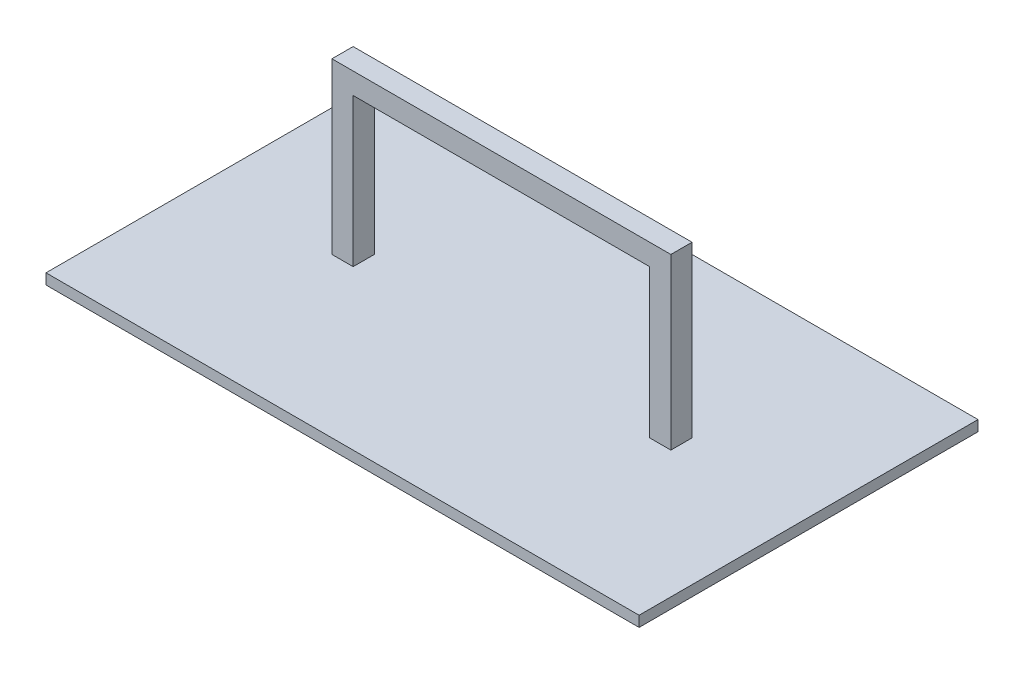
ISO-10303-21;
HEADER;
FILE_DESCRIPTION(('STEP AP214'),'2;1');
FILE_NAME('part.step','',(''),(''),'','','');
FILE_SCHEMA(('AUTOMOTIVE_DESIGN { 1 0 10303 214 1 1 1 1 }'));
ENDSEC;
DATA;
#1=APPLICATION_CONTEXT('core data for automotive mechanical design processes');
#2=APPLICATION_PROTOCOL_DEFINITION('international standard','automotive_design',2000,#1);
#3=PRODUCT_CONTEXT('',#1,'mechanical');
#4=PRODUCT('Part','Part','',(#3));
#5=PRODUCT_RELATED_PRODUCT_CATEGORY('part','',(#4));
#6=PRODUCT_DEFINITION_FORMATION('','',#4);
#7=PRODUCT_DEFINITION_CONTEXT('part definition',#1,'design');
#8=PRODUCT_DEFINITION('design','',#6,#7);
#9=PRODUCT_DEFINITION_SHAPE('','',#8);
#10=(LENGTH_UNIT() NAMED_UNIT(*) SI_UNIT(.MILLI.,.METRE.));
#11=(NAMED_UNIT(*) PLANE_ANGLE_UNIT() SI_UNIT($,.RADIAN.));
#12=(NAMED_UNIT(*) SI_UNIT($,.STERADIAN.) SOLID_ANGLE_UNIT());
#13=UNCERTAINTY_MEASURE_WITH_UNIT(LENGTH_MEASURE(1.E-05),#10,'distance_accuracy_value','');
#14=(GEOMETRIC_REPRESENTATION_CONTEXT(3) GLOBAL_UNCERTAINTY_ASSIGNED_CONTEXT((#13)) GLOBAL_UNIT_ASSIGNED_CONTEXT((#10,
#11,#12)) REPRESENTATION_CONTEXT('',''));
#15=CARTESIAN_POINT('',(0.,0.,0.));
#16=DIRECTION('',(0.,0.,1.));
#17=DIRECTION('',(1.,0.,0.));
#18=AXIS2_PLACEMENT_3D('',#15,#16,#17);
#19=CARTESIAN_POINT('',(0.,3.175,0.));
#20=DIRECTION('',(0.,1.,0.));
#21=DIRECTION('',(0.,0.,1.));
#22=AXIS2_PLACEMENT_3D('',#19,#20,#21);
#23=PLANE('',#22);
#24=DIRECTION('',(0.,0.,1.));
#25=VECTOR('',#24,1.);
#26=CARTESIAN_POINT('',(-177.8,3.175,-101.6));
#27=LINE('',#26,#25);
#28=CARTESIAN_POINT('',(-177.8,3.175,-101.6));
#29=VERTEX_POINT('',#28);
#30=CARTESIAN_POINT('',(-177.8,3.175,101.6));
#31=VERTEX_POINT('',#30);
#32=EDGE_CURVE('E187',#29,#31,#27,.T.);
#33=ORIENTED_EDGE('',*,*,#32,.T.);
#34=DIRECTION('',(1.,0.,0.));
#35=VECTOR('',#34,1.);
#36=CARTESIAN_POINT('',(-177.8,3.175,101.6));
#37=LINE('',#36,#35);
#38=CARTESIAN_POINT('',(177.8,3.175,101.6));
#39=VERTEX_POINT('',#38);
#40=EDGE_CURVE('E190',#31,#39,#37,.T.);
#41=ORIENTED_EDGE('',*,*,#40,.T.);
#42=DIRECTION('',(0.,0.,-1.));
#43=VECTOR('',#42,1.);
#44=CARTESIAN_POINT('',(177.8,3.175,-101.6));
#45=LINE('',#44,#43);
#46=CARTESIAN_POINT('',(177.8,3.175,-101.6));
#47=VERTEX_POINT('',#46);
#48=EDGE_CURVE('E193',#39,#47,#45,.T.);
#49=ORIENTED_EDGE('',*,*,#48,.T.);
#50=DIRECTION('',(-1.,0.,0.));
#51=VECTOR('',#50,1.);
#52=CARTESIAN_POINT('',(-177.8,3.175,-101.6));
#53=LINE('',#52,#51);
#54=EDGE_CURVE('E195',#47,#29,#53,.T.);
#55=ORIENTED_EDGE('',*,*,#54,.T.);
#56=EDGE_LOOP('',(#33,#41,#49,#55));
#57=FACE_BOUND('',#56,.T.);
#58=DIRECTION('',(0.,0.,-1.));
#59=VECTOR('',#58,1.);
#60=CARTESIAN_POINT('',(-88.9,3.17499999999998,6.35));
#61=LINE('',#60,#59);
#62=CARTESIAN_POINT('',(-88.9,3.175,6.35));
#63=VERTEX_POINT('',#62);
#64=CARTESIAN_POINT('',(-88.9,3.175,-6.35));
#65=VERTEX_POINT('',#64);
#66=EDGE_CURVE('E138',#63,#65,#61,.T.);
#67=ORIENTED_EDGE('',*,*,#66,.F.);
#68=DIRECTION('',(1.,0.,0.));
#69=VECTOR('',#68,1.);
#70=CARTESIAN_POINT('',(-88.9,3.17499999999998,6.35));
#71=LINE('',#70,#69);
#72=CARTESIAN_POINT('',(-101.6,3.175,6.35));
#73=VERTEX_POINT('',#72);
#74=EDGE_CURVE('E127',#73,#63,#71,.T.);
#75=ORIENTED_EDGE('',*,*,#74,.F.);
#76=DIRECTION('',(0.,0.,-1.));
#77=VECTOR('',#76,1.);
#78=CARTESIAN_POINT('',(-101.6,3.17499999999998,6.35));
#79=LINE('',#78,#77);
#80=CARTESIAN_POINT('',(-101.6,3.17499999999998,-6.35));
#81=VERTEX_POINT('',#80);
#82=EDGE_CURVE('E156',#73,#81,#79,.T.);
#83=ORIENTED_EDGE('',*,*,#82,.T.);
#84=DIRECTION('',(1.,0.,0.));
#85=VECTOR('',#84,1.);
#86=CARTESIAN_POINT('',(-88.9,3.17499999999998,-6.35));
#87=LINE('',#86,#85);
#88=EDGE_CURVE('E157',#81,#65,#87,.T.);
#89=ORIENTED_EDGE('',*,*,#88,.T.);
#90=EDGE_LOOP('',(#67,#75,#83,#89));
#91=FACE_BOUND('',#90,.T.);
#92=DIRECTION('',(0.,0.,-1.));
#93=VECTOR('',#92,1.);
#94=CARTESIAN_POINT('',(101.6,3.17500000000001,6.35));
#95=LINE('',#94,#93);
#96=CARTESIAN_POINT('',(101.6,3.175,6.35));
#97=VERTEX_POINT('',#96);
#98=CARTESIAN_POINT('',(101.6,3.175,-6.35));
#99=VERTEX_POINT('',#98);
#100=EDGE_CURVE('E53',#97,#99,#95,.T.);
#101=ORIENTED_EDGE('',*,*,#100,.F.);
#102=DIRECTION('',(1.,0.,0.));
#103=VECTOR('',#102,1.);
#104=CARTESIAN_POINT('',(101.6,3.17500000000001,6.35));
#105=LINE('',#104,#103);
#106=CARTESIAN_POINT('',(88.9,3.175,6.35));
#107=VERTEX_POINT('',#106);
#108=EDGE_CURVE('E48',#107,#97,#105,.T.);
#109=ORIENTED_EDGE('',*,*,#108,.F.);
#110=DIRECTION('',(0.,0.,-1.));
#111=VECTOR('',#110,1.);
#112=CARTESIAN_POINT('',(88.9,3.175,6.35));
#113=LINE('',#112,#111);
#114=CARTESIAN_POINT('',(88.9,3.175,-6.35));
#115=VERTEX_POINT('',#114);
#116=EDGE_CURVE('E182',#107,#115,#113,.T.);
#117=ORIENTED_EDGE('',*,*,#116,.T.);
#118=DIRECTION('',(1.,0.,0.));
#119=VECTOR('',#118,1.);
#120=CARTESIAN_POINT('',(101.6,3.17500000000001,-6.35));
#121=LINE('',#120,#119);
#122=EDGE_CURVE('E165',#115,#99,#121,.T.);
#123=ORIENTED_EDGE('',*,*,#122,.T.);
#124=EDGE_LOOP('',(#101,#109,#117,#123));
#125=FACE_BOUND('',#124,.T.);
#126=ADVANCED_FACE('F33',(#57,#91,#125),#23,.T.);
#127=CARTESIAN_POINT('',(-177.8,3.175,-101.6));
#128=DIRECTION('',(1.,0.,0.));
#129=DIRECTION('',(0.,0.,-1.));
#130=AXIS2_PLACEMENT_3D('',#127,#128,#129);
#131=PLANE('',#130);
#132=DIRECTION('',(0.,0.,1.));
#133=VECTOR('',#132,1.);
#134=CARTESIAN_POINT('',(-177.8,-3.175,-101.6));
#135=LINE('',#134,#133);
#136=CARTESIAN_POINT('',(-177.8,-3.175,-101.6));
#137=VERTEX_POINT('',#136);
#138=CARTESIAN_POINT('',(-177.8,-3.175,101.6));
#139=VERTEX_POINT('',#138);
#140=EDGE_CURVE('E186',#137,#139,#135,.T.);
#141=ORIENTED_EDGE('',*,*,#140,.T.);
#142=DIRECTION('',(0.,-1.,0.));
#143=VECTOR('',#142,1.);
#144=CARTESIAN_POINT('',(-177.8,3.175,101.6));
#145=LINE('',#144,#143);
#146=EDGE_CURVE('E11',#31,#139,#145,.T.);
#147=ORIENTED_EDGE('',*,*,#146,.F.);
#148=ORIENTED_EDGE('',*,*,#32,.F.);
#149=DIRECTION('',(0.,-1.,0.));
#150=VECTOR('',#149,1.);
#151=CARTESIAN_POINT('',(-177.8,3.175,-101.6));
#152=LINE('',#151,#150);
#153=EDGE_CURVE('E197',#29,#137,#152,.T.);
#154=ORIENTED_EDGE('',*,*,#153,.T.);
#155=EDGE_LOOP('',(#141,#147,#148,#154));
#156=FACE_BOUND('',#155,.T.);
#157=ADVANCED_FACE('F35',(#156),#131,.F.);
#158=CARTESIAN_POINT('',(-177.8,3.175,101.6));
#159=DIRECTION('',(0.,0.,-1.));
#160=DIRECTION('',(-1.,0.,0.));
#161=AXIS2_PLACEMENT_3D('',#158,#159,#160);
#162=PLANE('',#161);
#163=DIRECTION('',(1.,0.,0.));
#164=VECTOR('',#163,1.);
#165=CARTESIAN_POINT('',(-177.8,-3.175,101.6));
#166=LINE('',#165,#164);
#167=CARTESIAN_POINT('',(177.8,-3.175,101.6));
#168=VERTEX_POINT('',#167);
#169=EDGE_CURVE('E200',#139,#168,#166,.T.);
#170=ORIENTED_EDGE('',*,*,#169,.T.);
#171=DIRECTION('',(0.,-1.,0.));
#172=VECTOR('',#171,1.);
#173=CARTESIAN_POINT('',(177.8,3.175,101.6));
#174=LINE('',#173,#172);
#175=EDGE_CURVE('E41',#39,#168,#174,.T.);
#176=ORIENTED_EDGE('',*,*,#175,.F.);
#177=ORIENTED_EDGE('',*,*,#40,.F.);
#178=ORIENTED_EDGE('',*,*,#146,.T.);
#179=EDGE_LOOP('',(#170,#176,#177,#178));
#180=FACE_BOUND('',#179,.T.);
#181=ADVANCED_FACE('F230',(#180),#162,.F.);
#182=CARTESIAN_POINT('',(177.8,3.175,-101.6));
#183=DIRECTION('',(-1.,0.,0.));
#184=DIRECTION('',(0.,0.,1.));
#185=AXIS2_PLACEMENT_3D('',#182,#183,#184);
#186=PLANE('',#185);
#187=DIRECTION('',(0.,0.,-1.));
#188=VECTOR('',#187,1.);
#189=CARTESIAN_POINT('',(177.8,-3.175,-101.6));
#190=LINE('',#189,#188);
#191=CARTESIAN_POINT('',(177.8,-3.175,-101.6));
#192=VERTEX_POINT('',#191);
#193=EDGE_CURVE('E202',#168,#192,#190,.T.);
#194=ORIENTED_EDGE('',*,*,#193,.T.);
#195=DIRECTION('',(0.,-1.,0.));
#196=VECTOR('',#195,1.);
#197=CARTESIAN_POINT('',(177.8,3.175,-101.6));
#198=LINE('',#197,#196);
#199=EDGE_CURVE('E207',#47,#192,#198,.T.);
#200=ORIENTED_EDGE('',*,*,#199,.F.);
#201=ORIENTED_EDGE('',*,*,#48,.F.);
#202=ORIENTED_EDGE('',*,*,#175,.T.);
#203=EDGE_LOOP('',(#194,#200,#201,#202));
#204=FACE_BOUND('',#203,.T.);
#205=ADVANCED_FACE('F214',(#204),#186,.F.);
#206=CARTESIAN_POINT('',(-177.8,3.175,-101.6));
#207=DIRECTION('',(0.,0.,1.));
#208=DIRECTION('',(1.,0.,0.));
#209=AXIS2_PLACEMENT_3D('',#206,#207,#208);
#210=PLANE('',#209);
#211=DIRECTION('',(-1.,0.,0.));
#212=VECTOR('',#211,1.);
#213=CARTESIAN_POINT('',(-177.8,-3.175,-101.6));
#214=LINE('',#213,#212);
#215=EDGE_CURVE('E191',#192,#137,#214,.T.);
#216=ORIENTED_EDGE('',*,*,#215,.T.);
#217=ORIENTED_EDGE('',*,*,#153,.F.);
#218=ORIENTED_EDGE('',*,*,#54,.F.);
#219=ORIENTED_EDGE('',*,*,#199,.T.);
#220=EDGE_LOOP('',(#216,#217,#218,#219));
#221=FACE_BOUND('',#220,.T.);
#222=ADVANCED_FACE('F223',(#221),#210,.F.);
#223=CARTESIAN_POINT('',(0.,-3.175,0.));
#224=DIRECTION('',(0.,1.,0.));
#225=DIRECTION('',(0.,0.,1.));
#226=AXIS2_PLACEMENT_3D('',#223,#224,#225);
#227=PLANE('',#226);
#228=ORIENTED_EDGE('',*,*,#140,.F.);
#229=ORIENTED_EDGE('',*,*,#215,.F.);
#230=ORIENTED_EDGE('',*,*,#193,.F.);
#231=ORIENTED_EDGE('',*,*,#169,.F.);
#232=EDGE_LOOP('',(#228,#229,#230,#231));
#233=FACE_BOUND('',#232,.T.);
#234=ADVANCED_FACE('F220',(#233),#227,.F.);
#235=CARTESIAN_POINT('',(-88.9,92.0749999999999,6.35));
#236=DIRECTION('',(-1.,0.,0.));
#237=DIRECTION('',(0.,-1.,0.));
#238=AXIS2_PLACEMENT_3D('',#235,#236,#237);
#239=PLANE('',#238);
#240=DIRECTION('',(0.,1.,0.));
#241=VECTOR('',#240,1.);
#242=CARTESIAN_POINT('',(-88.9,92.0749999999999,-6.35));
#243=LINE('',#242,#241);
#244=CARTESIAN_POINT('',(-88.9,92.0749999999999,-6.35));
#245=VERTEX_POINT('',#244);
#246=EDGE_CURVE('E135',#65,#245,#243,.T.);
#247=ORIENTED_EDGE('',*,*,#246,.T.);
#248=DIRECTION('',(0.,0.,-1.));
#249=VECTOR('',#248,1.);
#250=CARTESIAN_POINT('',(-88.9,92.0749999999999,6.35));
#251=LINE('',#250,#249);
#252=CARTESIAN_POINT('',(-88.9,92.0749999999999,6.35));
#253=VERTEX_POINT('',#252);
#254=EDGE_CURVE('E132',#253,#245,#251,.T.);
#255=ORIENTED_EDGE('',*,*,#254,.F.);
#256=DIRECTION('',(0.,1.,0.));
#257=VECTOR('',#256,1.);
#258=CARTESIAN_POINT('',(-88.9,92.0749999999999,6.35));
#259=LINE('',#258,#257);
#260=EDGE_CURVE('E120',#63,#253,#259,.T.);
#261=ORIENTED_EDGE('',*,*,#260,.F.);
#262=ORIENTED_EDGE('',*,*,#66,.T.);
#263=EDGE_LOOP('',(#247,#255,#261,#262));
#264=FACE_BOUND('',#263,.T.);
#265=ADVANCED_FACE('F133',(#264),#239,.F.);
#266=CARTESIAN_POINT('',(88.9,92.075,6.35));
#267=DIRECTION('',(0.,1.,0.));
#268=DIRECTION('',(-1.,0.,0.));
#269=AXIS2_PLACEMENT_3D('',#266,#267,#268);
#270=PLANE('',#269);
#271=DIRECTION('',(1.,0.,0.));
#272=VECTOR('',#271,1.);
#273=CARTESIAN_POINT('',(88.9,92.075,-6.35));
#274=LINE('',#273,#272);
#275=CARTESIAN_POINT('',(88.9,92.075,-6.35));
#276=VERTEX_POINT('',#275);
#277=EDGE_CURVE('E160',#245,#276,#274,.T.);
#278=ORIENTED_EDGE('',*,*,#277,.T.);
#279=DIRECTION('',(0.,0.,-1.));
#280=VECTOR('',#279,1.);
#281=CARTESIAN_POINT('',(88.9,92.075,6.35));
#282=LINE('',#281,#280);
#283=CARTESIAN_POINT('',(88.9,92.075,6.35));
#284=VERTEX_POINT('',#283);
#285=EDGE_CURVE('E139',#284,#276,#282,.T.);
#286=ORIENTED_EDGE('',*,*,#285,.F.);
#287=DIRECTION('',(1.,0.,0.));
#288=VECTOR('',#287,1.);
#289=CARTESIAN_POINT('',(88.9,92.075,6.35));
#290=LINE('',#289,#288);
#291=EDGE_CURVE('E124',#253,#284,#290,.T.);
#292=ORIENTED_EDGE('',*,*,#291,.F.);
#293=ORIENTED_EDGE('',*,*,#254,.T.);
#294=EDGE_LOOP('',(#278,#286,#292,#293));
#295=FACE_BOUND('',#294,.T.);
#296=ADVANCED_FACE('F141',(#295),#270,.F.);
#297=CARTESIAN_POINT('',(88.9,3.175,6.35));
#298=DIRECTION('',(1.,0.,0.));
#299=DIRECTION('',(0.,1.,0.));
#300=AXIS2_PLACEMENT_3D('',#297,#298,#299);
#301=PLANE('',#300);
#302=DIRECTION('',(0.,-1.,0.));
#303=VECTOR('',#302,1.);
#304=CARTESIAN_POINT('',(88.9,3.175,-6.35));
#305=LINE('',#304,#303);
#306=EDGE_CURVE('E162',#276,#115,#305,.T.);
#307=ORIENTED_EDGE('',*,*,#306,.T.);
#308=ORIENTED_EDGE('',*,*,#116,.F.);
#309=DIRECTION('',(0.,-1.,0.));
#310=VECTOR('',#309,1.);
#311=CARTESIAN_POINT('',(88.9,3.175,6.35));
#312=LINE('',#311,#310);
#313=EDGE_CURVE('E144',#284,#107,#312,.T.);
#314=ORIENTED_EDGE('',*,*,#313,.F.);
#315=ORIENTED_EDGE('',*,*,#285,.T.);
#316=EDGE_LOOP('',(#307,#308,#314,#315));
#317=FACE_BOUND('',#316,.T.);
#318=ADVANCED_FACE('F266',(#317),#301,.F.);
#319=CARTESIAN_POINT('',(101.6,104.775,6.35));
#320=DIRECTION('',(-1.,0.,0.));
#321=DIRECTION('',(0.,-1.,0.));
#322=AXIS2_PLACEMENT_3D('',#319,#320,#321);
#323=PLANE('',#322);
#324=DIRECTION('',(0.,1.,0.));
#325=VECTOR('',#324,1.);
#326=CARTESIAN_POINT('',(101.6,104.775,-6.35));
#327=LINE('',#326,#325);
#328=CARTESIAN_POINT('',(101.6,104.775,-6.35));
#329=VERTEX_POINT('',#328);
#330=EDGE_CURVE('E167',#99,#329,#327,.T.);
#331=ORIENTED_EDGE('',*,*,#330,.T.);
#332=DIRECTION('',(0.,0.,-1.));
#333=VECTOR('',#332,1.);
#334=CARTESIAN_POINT('',(101.6,104.775,6.35));
#335=LINE('',#334,#333);
#336=CARTESIAN_POINT('',(101.6,104.775,6.35));
#337=VERTEX_POINT('',#336);
#338=EDGE_CURVE('E178',#337,#329,#335,.T.);
#339=ORIENTED_EDGE('',*,*,#338,.F.);
#340=DIRECTION('',(0.,1.,0.));
#341=VECTOR('',#340,1.);
#342=CARTESIAN_POINT('',(101.6,104.775,6.35));
#343=LINE('',#342,#341);
#344=EDGE_CURVE('E150',#97,#337,#343,.T.);
#345=ORIENTED_EDGE('',*,*,#344,.F.);
#346=ORIENTED_EDGE('',*,*,#100,.T.);
#347=EDGE_LOOP('',(#331,#339,#345,#346));
#348=FACE_BOUND('',#347,.T.);
#349=ADVANCED_FACE('F272',(#348),#323,.F.);
#350=CARTESIAN_POINT('',(-101.6,104.775,6.35));
#351=DIRECTION('',(0.,-1.,0.));
#352=DIRECTION('',(1.,0.,0.));
#353=AXIS2_PLACEMENT_3D('',#350,#351,#352);
#354=PLANE('',#353);
#355=DIRECTION('',(-1.,0.,0.));
#356=VECTOR('',#355,1.);
#357=CARTESIAN_POINT('',(-101.6,104.775,-6.35));
#358=LINE('',#357,#356);
#359=CARTESIAN_POINT('',(-101.6,104.775,-6.35));
#360=VERTEX_POINT('',#359);
#361=EDGE_CURVE('E169',#329,#360,#358,.T.);
#362=ORIENTED_EDGE('',*,*,#361,.T.);
#363=DIRECTION('',(0.,0.,-1.));
#364=VECTOR('',#363,1.);
#365=CARTESIAN_POINT('',(-101.6,104.775,6.35));
#366=LINE('',#365,#364);
#367=CARTESIAN_POINT('',(-101.6,104.775,6.35));
#368=VERTEX_POINT('',#367);
#369=EDGE_CURVE('E175',#368,#360,#366,.T.);
#370=ORIENTED_EDGE('',*,*,#369,.F.);
#371=DIRECTION('',(-1.,0.,0.));
#372=VECTOR('',#371,1.);
#373=CARTESIAN_POINT('',(-101.6,104.775,6.35));
#374=LINE('',#373,#372);
#375=EDGE_CURVE('E152',#337,#368,#374,.T.);
#376=ORIENTED_EDGE('',*,*,#375,.F.);
#377=ORIENTED_EDGE('',*,*,#338,.T.);
#378=EDGE_LOOP('',(#362,#370,#376,#377));
#379=FACE_BOUND('',#378,.T.);
#380=ADVANCED_FACE('F280',(#379),#354,.F.);
#381=CARTESIAN_POINT('',(-101.6,3.17499999999998,6.35));
#382=DIRECTION('',(1.,0.,0.));
#383=DIRECTION('',(0.,0.,-1.));
#384=AXIS2_PLACEMENT_3D('',#381,#382,#383);
#385=PLANE('',#384);
#386=DIRECTION('',(0.,-1.,0.));
#387=VECTOR('',#386,1.);
#388=CARTESIAN_POINT('',(-101.6,3.17499999999998,-6.35));
#389=LINE('',#388,#387);
#390=EDGE_CURVE('E171',#360,#81,#389,.T.);
#391=ORIENTED_EDGE('',*,*,#390,.T.);
#392=ORIENTED_EDGE('',*,*,#82,.F.);
#393=DIRECTION('',(0.,-1.,0.));
#394=VECTOR('',#393,1.);
#395=CARTESIAN_POINT('',(-101.6,3.17499999999998,6.35));
#396=LINE('',#395,#394);
#397=EDGE_CURVE('E154',#368,#73,#396,.T.);
#398=ORIENTED_EDGE('',*,*,#397,.F.);
#399=ORIENTED_EDGE('',*,*,#369,.T.);
#400=EDGE_LOOP('',(#391,#392,#398,#399));
#401=FACE_BOUND('',#400,.T.);
#402=ADVANCED_FACE('F288',(#401),#385,.F.);
#403=CARTESIAN_POINT('',(0.,0.,6.35));
#404=DIRECTION('',(0.,0.,-1.));
#405=DIRECTION('',(-1.,0.,0.));
#406=AXIS2_PLACEMENT_3D('',#403,#404,#405);
#407=PLANE('',#406);
#408=ORIENTED_EDGE('',*,*,#74,.T.);
#409=ORIENTED_EDGE('',*,*,#260,.T.);
#410=ORIENTED_EDGE('',*,*,#291,.T.);
#411=ORIENTED_EDGE('',*,*,#313,.T.);
#412=ORIENTED_EDGE('',*,*,#108,.T.);
#413=ORIENTED_EDGE('',*,*,#344,.T.);
#414=ORIENTED_EDGE('',*,*,#375,.T.);
#415=ORIENTED_EDGE('',*,*,#397,.T.);
#416=EDGE_LOOP('',(#408,#409,#410,#411,#412,#413,#414,#415));
#417=FACE_BOUND('',#416,.T.);
#418=ADVANCED_FACE('F122',(#417),#407,.F.);
#419=CARTESIAN_POINT('',(0.,0.,-6.35));
#420=DIRECTION('',(0.,0.,-1.));
#421=DIRECTION('',(-1.,0.,0.));
#422=AXIS2_PLACEMENT_3D('',#419,#420,#421);
#423=PLANE('',#422);
#424=ORIENTED_EDGE('',*,*,#88,.F.);
#425=ORIENTED_EDGE('',*,*,#390,.F.);
#426=ORIENTED_EDGE('',*,*,#361,.F.);
#427=ORIENTED_EDGE('',*,*,#330,.F.);
#428=ORIENTED_EDGE('',*,*,#122,.F.);
#429=ORIENTED_EDGE('',*,*,#306,.F.);
#430=ORIENTED_EDGE('',*,*,#277,.F.);
#431=ORIENTED_EDGE('',*,*,#246,.F.);
#432=EDGE_LOOP('',(#424,#425,#426,#427,#428,#429,#430,#431));
#433=FACE_BOUND('',#432,.T.);
#434=ADVANCED_FACE('F303',(#433),#423,.T.);
#435=CLOSED_SHELL('',(#126,#157,#181,#205,#222,#234,#265,#296,#318,#349,#380,#402,#418,#434));
#436=MANIFOLD_SOLID_BREP('B2',#435);
#437=ADVANCED_BREP_SHAPE_REPRESENTATION('',(#18,#436),#14);
#438=SHAPE_DEFINITION_REPRESENTATION(#9,#437);
ENDSEC;
END-ISO-10303-21;
